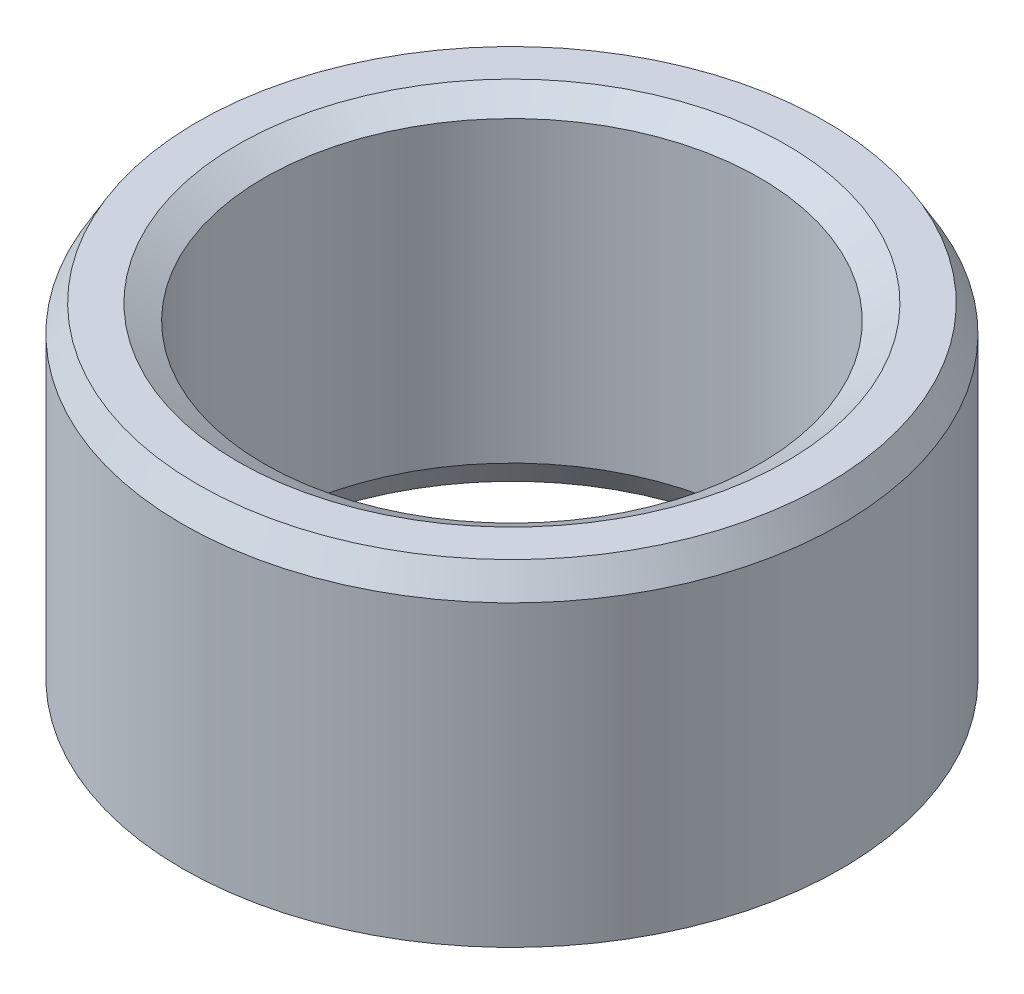
ISO-10303-21;
HEADER;
FILE_DESCRIPTION(('STEP AP214'),'2;1');
FILE_NAME('part.step','',(''),(''),'','','');
FILE_SCHEMA(('AUTOMOTIVE_DESIGN { 1 0 10303 214 1 1 1 1 }'));
ENDSEC;
DATA;
#1=APPLICATION_CONTEXT('core data for automotive mechanical design processes');
#2=APPLICATION_PROTOCOL_DEFINITION('international standard','automotive_design',2000,#1);
#3=PRODUCT_CONTEXT('',#1,'mechanical');
#4=PRODUCT('Part','Part','',(#3));
#5=PRODUCT_RELATED_PRODUCT_CATEGORY('part','',(#4));
#6=PRODUCT_DEFINITION_FORMATION('','',#4);
#7=PRODUCT_DEFINITION_CONTEXT('part definition',#1,'design');
#8=PRODUCT_DEFINITION('design','',#6,#7);
#9=PRODUCT_DEFINITION_SHAPE('','',#8);
#10=(LENGTH_UNIT() NAMED_UNIT(*) SI_UNIT(.MILLI.,.METRE.));
#11=(NAMED_UNIT(*) PLANE_ANGLE_UNIT() SI_UNIT($,.RADIAN.));
#12=(NAMED_UNIT(*) SI_UNIT($,.STERADIAN.) SOLID_ANGLE_UNIT());
#13=UNCERTAINTY_MEASURE_WITH_UNIT(LENGTH_MEASURE(1.E-05),#10,'distance_accuracy_value','');
#14=(GEOMETRIC_REPRESENTATION_CONTEXT(3) GLOBAL_UNCERTAINTY_ASSIGNED_CONTEXT((#13)) GLOBAL_UNIT_ASSIGNED_CONTEXT((#10,
#11,#12)) REPRESENTATION_CONTEXT('',''));
#15=CARTESIAN_POINT('',(0.,0.,0.));
#16=DIRECTION('',(0.,0.,1.));
#17=DIRECTION('',(1.,0.,0.));
#18=AXIS2_PLACEMENT_3D('',#15,#16,#17);
#19=CARTESIAN_POINT('',(0.,30.9848019725767,0.));
#20=DIRECTION('',(0.,-1.,0.));
#21=DIRECTION('',(0.,0.,-1.));
#22=AXIS2_PLACEMENT_3D('',#19,#20,#21);
#23=CYLINDRICAL_SURFACE('',#22,30.);
#24=CARTESIAN_POINT('',(0.,1.40024096263477,0.));
#25=DIRECTION('',(0.,1.,0.));
#26=DIRECTION('',(0.,0.,1.));
#27=AXIS2_PLACEMENT_3D('',#24,#25,#26);
#28=CIRCLE('',#27,30.);
#29=CARTESIAN_POINT('',(0.,1.40024096263477,30.));
#30=VERTEX_POINT('',#29);
#31=EDGE_CURVE('E10',#30,#30,#28,.T.);
#32=ORIENTED_EDGE('',*,*,#31,.T.);
#33=EDGE_LOOP('',(#32));
#34=FACE_BOUND('',#33,.T.);
#35=CARTESIAN_POINT('',(0.,28.5595134824541,0.));
#36=DIRECTION('',(0.,1.,0.));
#37=DIRECTION('',(0.,0.,1.));
#38=AXIS2_PLACEMENT_3D('',#35,#36,#37);
#39=CIRCLE('',#38,30.);
#40=CARTESIAN_POINT('',(0.,28.5595134824541,30.));
#41=VERTEX_POINT('',#40);
#42=EDGE_CURVE('E50',#41,#41,#39,.F.);
#43=ORIENTED_EDGE('',*,*,#42,.T.);
#44=EDGE_LOOP('',(#43));
#45=FACE_BOUND('',#44,.T.);
#46=ADVANCED_FACE('F39',(#34,#45),#23,.T.);
#47=CARTESIAN_POINT('',(0.,30.9848019725767,0.));
#48=DIRECTION('',(0.,1.,0.));
#49=DIRECTION('',(0.,0.,1.));
#50=AXIS2_PLACEMENT_3D('',#47,#48,#49);
#51=PLANE('',#50);
#52=CARTESIAN_POINT('',(0.,30.9848019725767,0.));
#53=DIRECTION('',(0.,1.,0.));
#54=DIRECTION('',(0.,0.,1.));
#55=AXIS2_PLACEMENT_3D('',#52,#53,#54);
#56=CIRCLE('',#55,24.9768413382514);
#57=CARTESIAN_POINT('',(0.,30.9848019725767,24.9768413382514));
#58=VERTEX_POINT('',#57);
#59=EDGE_CURVE('E58',#58,#58,#56,.F.);
#60=ORIENTED_EDGE('',*,*,#59,.T.);
#61=EDGE_LOOP('',(#60));
#62=FACE_BOUND('',#61,.T.);
#63=CARTESIAN_POINT('',(0.,30.9848019725767,0.));
#64=DIRECTION('',(0.,1.,0.));
#65=DIRECTION('',(0.,0.,1.));
#66=AXIS2_PLACEMENT_3D('',#63,#64,#65);
#67=CIRCLE('',#66,28.5997590373652);
#68=CARTESIAN_POINT('',(0.,30.9848019725767,28.5997590373652));
#69=VERTEX_POINT('',#68);
#70=EDGE_CURVE('E61',#69,#69,#67,.T.);
#71=ORIENTED_EDGE('',*,*,#70,.T.);
#72=EDGE_LOOP('',(#71));
#73=FACE_BOUND('',#72,.T.);
#74=ADVANCED_FACE('F88',(#62,#73),#51,.T.);
#75=CARTESIAN_POINT('',(0.,0.,0.));
#76=DIRECTION('',(0.,1.,0.));
#77=DIRECTION('',(0.,0.,1.));
#78=AXIS2_PLACEMENT_3D('',#75,#76,#77);
#79=PLANE('',#78);
#80=CARTESIAN_POINT('',(0.,0.,0.));
#81=DIRECTION('',(0.,1.,0.));
#82=DIRECTION('',(0.,0.,1.));
#83=AXIS2_PLACEMENT_3D('',#80,#81,#82);
#84=CIRCLE('',#83,23.9517938107636);
#85=CARTESIAN_POINT('',(0.,0.,23.9517938107636));
#86=VERTEX_POINT('',#85);
#87=EDGE_CURVE('E51',#86,#86,#84,.T.);
#88=ORIENTED_EDGE('',*,*,#87,.T.);
#89=EDGE_LOOP('',(#88));
#90=FACE_BOUND('',#89,.T.);
#91=CARTESIAN_POINT('',(0.,0.,0.));
#92=DIRECTION('',(0.,1.,0.));
#93=DIRECTION('',(0.,0.,1.));
#94=AXIS2_PLACEMENT_3D('',#91,#92,#93);
#95=CIRCLE('',#94,27.5747115098774);
#96=CARTESIAN_POINT('',(0.,0.,27.5747115098774));
#97=VERTEX_POINT('',#96);
#98=EDGE_CURVE('E54',#97,#97,#95,.F.);
#99=ORIENTED_EDGE('',*,*,#98,.T.);
#100=EDGE_LOOP('',(#99));
#101=FACE_BOUND('',#100,.T.);
#102=ADVANCED_FACE('F83',(#90,#101),#79,.F.);
#103=CARTESIAN_POINT('',(0.,30.9848019725767,0.));
#104=DIRECTION('',(0.,-1.,0.));
#105=DIRECTION('',(0.,0.,-1.));
#106=AXIS2_PLACEMENT_3D('',#103,#104,#105);
#107=CYLINDRICAL_SURFACE('',#106,22.5515528481288);
#108=CARTESIAN_POINT('',(0.,29.584561009942,0.));
#109=DIRECTION('',(0.,1.,0.));
#110=DIRECTION('',(0.,0.,1.));
#111=AXIS2_PLACEMENT_3D('',#108,#109,#110);
#112=CIRCLE('',#111,22.5515528481288);
#113=CARTESIAN_POINT('',(0.,29.584561009942,22.5515528481288));
#114=VERTEX_POINT('',#113);
#115=EDGE_CURVE('E67',#114,#114,#112,.T.);
#116=ORIENTED_EDGE('',*,*,#115,.T.);
#117=EDGE_LOOP('',(#116));
#118=FACE_BOUND('',#117,.T.);
#119=CARTESIAN_POINT('',(0.,2.42528849012259,0.));
#120=DIRECTION('',(0.,1.,0.));
#121=DIRECTION('',(0.,0.,1.));
#122=AXIS2_PLACEMENT_3D('',#119,#120,#121);
#123=CIRCLE('',#122,22.5515528481288);
#124=CARTESIAN_POINT('',(0.,2.42528849012259,22.5515528481288));
#125=VERTEX_POINT('',#124);
#126=EDGE_CURVE('E69',#125,#125,#123,.F.);
#127=ORIENTED_EDGE('',*,*,#126,.T.);
#128=EDGE_LOOP('',(#127));
#129=FACE_BOUND('',#128,.T.);
#130=ADVANCED_FACE('F71',(#118,#129),#107,.F.);
#131=CARTESIAN_POINT('',(0.,29.584561009942,0.));
#132=DIRECTION('',(0.,1.,0.));
#133=DIRECTION('',(0.,0.,1.));
#134=AXIS2_PLACEMENT_3D('',#131,#132,#133);
#135=CONICAL_SURFACE('',#134,22.5515528481288,1.0471975511966);
#136=ORIENTED_EDGE('',*,*,#59,.F.);
#137=EDGE_LOOP('',(#136));
#138=FACE_BOUND('',#137,.T.);
#139=ORIENTED_EDGE('',*,*,#115,.F.);
#140=EDGE_LOOP('',(#139));
#141=FACE_BOUND('',#140,.T.);
#142=ADVANCED_FACE('F77',(#138,#141),#135,.F.);
#143=CARTESIAN_POINT('',(0.,0.,0.));
#144=DIRECTION('',(0.,-1.,0.));
#145=DIRECTION('',(0.,0.,-1.));
#146=AXIS2_PLACEMENT_3D('',#143,#144,#145);
#147=CONICAL_SURFACE('',#146,23.9517938107636,0.523598775598296);
#148=ORIENTED_EDGE('',*,*,#126,.F.);
#149=EDGE_LOOP('',(#148));
#150=FACE_BOUND('',#149,.T.);
#151=ORIENTED_EDGE('',*,*,#87,.F.);
#152=EDGE_LOOP('',(#151));
#153=FACE_BOUND('',#152,.T.);
#154=ADVANCED_FACE('F73',(#150,#153),#147,.F.);
#155=CARTESIAN_POINT('',(0.,1.40024096263477,0.));
#156=DIRECTION('',(0.,1.,0.));
#157=DIRECTION('',(0.,0.,1.));
#158=AXIS2_PLACEMENT_3D('',#155,#156,#157);
#159=CONICAL_SURFACE('',#158,30.,1.0471975511966);
#160=ORIENTED_EDGE('',*,*,#98,.F.);
#161=EDGE_LOOP('',(#160));
#162=FACE_BOUND('',#161,.T.);
#163=ORIENTED_EDGE('',*,*,#31,.F.);
#164=EDGE_LOOP('',(#163));
#165=FACE_BOUND('',#164,.T.);
#166=ADVANCED_FACE('F76',(#162,#165),#159,.T.);
#167=CARTESIAN_POINT('',(0.,30.9848019725767,0.));
#168=DIRECTION('',(0.,-1.,0.));
#169=DIRECTION('',(0.,0.,-1.));
#170=AXIS2_PLACEMENT_3D('',#167,#168,#169);
#171=CONICAL_SURFACE('',#170,28.5997590373652,0.523598775598297);
#172=ORIENTED_EDGE('',*,*,#42,.F.);
#173=EDGE_LOOP('',(#172));
#174=FACE_BOUND('',#173,.T.);
#175=ORIENTED_EDGE('',*,*,#70,.F.);
#176=EDGE_LOOP('',(#175));
#177=FACE_BOUND('',#176,.T.);
#178=ADVANCED_FACE('F45',(#174,#177),#171,.T.);
#179=CLOSED_SHELL('',(#46,#74,#102,#130,#142,#154,#166,#178));
#180=MANIFOLD_SOLID_BREP('B2',#179);
#181=ADVANCED_BREP_SHAPE_REPRESENTATION('',(#18,#180),#14);
#182=SHAPE_DEFINITION_REPRESENTATION(#9,#181);
ENDSEC;
END-ISO-10303-21;
